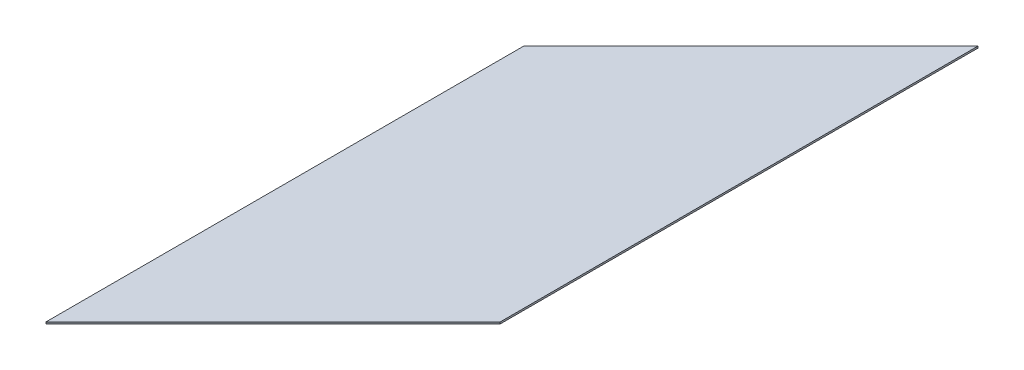
ISO-10303-21;
HEADER;
FILE_DESCRIPTION(('STEP AP214'),'2;1');
FILE_NAME('part.step','',(''),(''),'','','');
FILE_SCHEMA(('AUTOMOTIVE_DESIGN { 1 0 10303 214 1 1 1 1 }'));
ENDSEC;
DATA;
#1=APPLICATION_CONTEXT('core data for automotive mechanical design processes');
#2=APPLICATION_PROTOCOL_DEFINITION('international standard','automotive_design',2000,#1);
#3=PRODUCT_CONTEXT('',#1,'mechanical');
#4=PRODUCT('Part','Part','',(#3));
#5=PRODUCT_RELATED_PRODUCT_CATEGORY('part','',(#4));
#6=PRODUCT_DEFINITION_FORMATION('','',#4);
#7=PRODUCT_DEFINITION_CONTEXT('part definition',#1,'design');
#8=PRODUCT_DEFINITION('design','',#6,#7);
#9=PRODUCT_DEFINITION_SHAPE('','',#8);
#10=(LENGTH_UNIT() NAMED_UNIT(*) SI_UNIT(.MILLI.,.METRE.));
#11=(NAMED_UNIT(*) PLANE_ANGLE_UNIT() SI_UNIT($,.RADIAN.));
#12=(NAMED_UNIT(*) SI_UNIT($,.STERADIAN.) SOLID_ANGLE_UNIT());
#13=UNCERTAINTY_MEASURE_WITH_UNIT(LENGTH_MEASURE(1.E-05),#10,'distance_accuracy_value','');
#14=(GEOMETRIC_REPRESENTATION_CONTEXT(3) GLOBAL_UNCERTAINTY_ASSIGNED_CONTEXT((#13)) GLOBAL_UNIT_ASSIGNED_CONTEXT((#10,
#11,#12)) REPRESENTATION_CONTEXT('',''));
#15=CARTESIAN_POINT('',(0.,0.,0.));
#16=DIRECTION('',(0.,0.,1.));
#17=DIRECTION('',(1.,0.,0.));
#18=AXIS2_PLACEMENT_3D('',#15,#16,#17);
#19=CARTESIAN_POINT('',(322.196671476108,2.54,0.0022903044861313));
#20=DIRECTION('',(0.999999999974735,0.,7.10840517247014E-06));
#21=DIRECTION('',(7.10840517247014E-06,0.,-0.999999999974735));
#22=AXIS2_PLACEMENT_3D('',#19,#20,#21);
#23=PLANE('',#22);
#24=DIRECTION('',(-7.10840517247014E-06,0.,0.999999999974735));
#25=VECTOR('',#24,1.);
#26=CARTESIAN_POINT('',(322.196671476108,0.,0.0022903044861313));
#27=LINE('',#26,#25);
#28=CARTESIAN_POINT('',(322.20049622294,0.,-538.057476738062));
#29=VERTEX_POINT('',#28);
#30=CARTESIAN_POINT('',(322.2,0.,-468.249562379727));
#31=VERTEX_POINT('',#30);
#32=EDGE_CURVE('E116',#29,#31,#27,.T.);
#33=ORIENTED_EDGE('',*,*,#32,.F.);
#34=DIRECTION('',(0.,-1.,0.));
#35=VECTOR('',#34,1.);
#36=CARTESIAN_POINT('',(322.20049622294,2.54,-538.057476738062));
#37=LINE('',#36,#35);
#38=CARTESIAN_POINT('',(322.20049622294,2.54,-538.057476738062));
#39=VERTEX_POINT('',#38);
#40=EDGE_CURVE('E11',#39,#29,#37,.T.);
#41=ORIENTED_EDGE('',*,*,#40,.F.);
#42=DIRECTION('',(-7.10840517247014E-06,0.,0.999999999974735));
#43=VECTOR('',#42,1.);
#44=CARTESIAN_POINT('',(322.196671476108,2.54,0.0022903044861313));
#45=LINE('',#44,#43);
#46=CARTESIAN_POINT('',(322.2,2.54,-468.249562379727));
#47=VERTEX_POINT('',#46);
#48=EDGE_CURVE('E127',#39,#47,#45,.T.);
#49=ORIENTED_EDGE('',*,*,#48,.T.);
#50=DIRECTION('',(0.,-1.,0.));
#51=VECTOR('',#50,1.);
#52=CARTESIAN_POINT('',(322.2,2.54,-468.249562379727));
#53=LINE('',#52,#51);
#54=EDGE_CURVE('E80',#47,#31,#53,.T.);
#55=ORIENTED_EDGE('',*,*,#54,.T.);
#56=EDGE_LOOP('',(#33,#41,#49,#55));
#57=FACE_BOUND('',#56,.T.);
#58=ADVANCED_FACE('F35',(#57),#23,.T.);
#59=CARTESIAN_POINT('',(322.20049622294,2.54,0.));
#60=DIRECTION('',(-1.,0.,0.));
#61=DIRECTION('',(0.,0.,1.));
#62=AXIS2_PLACEMENT_3D('',#59,#60,#61);
#63=PLANE('',#62);
#64=DIRECTION('',(0.,0.,-1.));
#65=VECTOR('',#64,1.);
#66=CARTESIAN_POINT('',(322.20049622294,0.,0.));
#67=LINE('',#66,#65);
#68=CARTESIAN_POINT('',(322.20049622294,0.,-1000.));
#69=VERTEX_POINT('',#68);
#70=EDGE_CURVE('E119',#29,#69,#67,.T.);
#71=ORIENTED_EDGE('',*,*,#70,.T.);
#72=DIRECTION('',(0.,-1.,0.));
#73=VECTOR('',#72,1.);
#74=CARTESIAN_POINT('',(322.20049622294,2.54,-1000.));
#75=LINE('',#74,#73);
#76=CARTESIAN_POINT('',(322.20049622294,2.54,-1000.));
#77=VERTEX_POINT('',#76);
#78=EDGE_CURVE('E43',#77,#69,#75,.T.);
#79=ORIENTED_EDGE('',*,*,#78,.F.);
#80=DIRECTION('',(0.,0.,-1.));
#81=VECTOR('',#80,1.);
#82=CARTESIAN_POINT('',(322.20049622294,2.54,0.));
#83=LINE('',#82,#81);
#84=EDGE_CURVE('E142',#39,#77,#83,.T.);
#85=ORIENTED_EDGE('',*,*,#84,.F.);
#86=ORIENTED_EDGE('',*,*,#40,.T.);
#87=EDGE_LOOP('',(#71,#79,#85,#86));
#88=FACE_BOUND('',#87,.T.);
#89=ADVANCED_FACE('F145',(#88),#63,.F.);
#90=CARTESIAN_POINT('',(-338.899751888529,2.54,-338.899751888525));
#91=DIRECTION('',(0.707106781186551,0.,0.707106781186544));
#92=DIRECTION('',(0.707106781186544,0.,-0.707106781186551));
#93=AXIS2_PLACEMENT_3D('',#90,#91,#92);
#94=PLANE('',#93);
#95=DIRECTION('',(-0.707106781186544,0.,0.707106781186551));
#96=VECTOR('',#95,1.);
#97=CARTESIAN_POINT('',(-338.899751888529,0.,-338.899751888525));
#98=LINE('',#97,#96);
#99=CARTESIAN_POINT('',(0.,0.,-677.799503777057));
#100=VERTEX_POINT('',#99);
#101=EDGE_CURVE('E121',#69,#100,#98,.T.);
#102=ORIENTED_EDGE('',*,*,#101,.T.);
#103=DIRECTION('',(0.,-1.,0.));
#104=VECTOR('',#103,1.);
#105=CARTESIAN_POINT('',(0.,2.54,-677.799503777057));
#106=LINE('',#105,#104);
#107=CARTESIAN_POINT('',(0.,2.54,-677.799503777057));
#108=VERTEX_POINT('',#107);
#109=EDGE_CURVE('E108',#108,#100,#106,.T.);
#110=ORIENTED_EDGE('',*,*,#109,.F.);
#111=DIRECTION('',(-0.707106781186544,0.,0.707106781186551));
#112=VECTOR('',#111,1.);
#113=CARTESIAN_POINT('',(-338.899751888529,2.54,-338.899751888525));
#114=LINE('',#113,#112);
#115=EDGE_CURVE('E99',#77,#108,#114,.T.);
#116=ORIENTED_EDGE('',*,*,#115,.F.);
#117=ORIENTED_EDGE('',*,*,#78,.T.);
#118=EDGE_LOOP('',(#102,#110,#116,#117));
#119=FACE_BOUND('',#118,.T.);
#120=ADVANCED_FACE('F134',(#119),#94,.F.);
#121=CARTESIAN_POINT('',(0.,2.54,0.));
#122=DIRECTION('',(1.,0.,0.));
#123=DIRECTION('',(0.,0.,-1.));
#124=AXIS2_PLACEMENT_3D('',#121,#122,#123);
#125=PLANE('',#124);
#126=DIRECTION('',(0.,0.,1.));
#127=VECTOR('',#126,1.);
#128=CARTESIAN_POINT('',(0.,0.,0.));
#129=LINE('',#128,#127);
#130=CARTESIAN_POINT('',(0.,0.,0.));
#131=VERTEX_POINT('',#130);
#132=EDGE_CURVE('E107',#100,#131,#129,.T.);
#133=ORIENTED_EDGE('',*,*,#132,.T.);
#134=DIRECTION('',(0.,-1.,0.));
#135=VECTOR('',#134,1.);
#136=CARTESIAN_POINT('',(0.,2.54,0.));
#137=LINE('',#136,#135);
#138=CARTESIAN_POINT('',(0.,2.54,0.));
#139=VERTEX_POINT('',#138);
#140=EDGE_CURVE('E104',#139,#131,#137,.T.);
#141=ORIENTED_EDGE('',*,*,#140,.F.);
#142=DIRECTION('',(0.,0.,1.));
#143=VECTOR('',#142,1.);
#144=CARTESIAN_POINT('',(0.,2.54,0.));
#145=LINE('',#144,#143);
#146=EDGE_CURVE('E93',#108,#139,#145,.T.);
#147=ORIENTED_EDGE('',*,*,#146,.F.);
#148=ORIENTED_EDGE('',*,*,#109,.T.);
#149=EDGE_LOOP('',(#133,#141,#147,#148));
#150=FACE_BOUND('',#149,.T.);
#151=ADVANCED_FACE('F105',(#150),#125,.F.);
#152=CARTESIAN_POINT('',(0.,2.54,0.));
#153=DIRECTION('',(-0.707106781186551,0.,-0.707106781186544));
#154=DIRECTION('',(-0.707106781186544,0.,0.707106781186551));
#155=AXIS2_PLACEMENT_3D('',#152,#153,#154);
#156=PLANE('',#155);
#157=DIRECTION('',(0.707106781186544,0.,-0.707106781186551));
#158=VECTOR('',#157,1.);
#159=CARTESIAN_POINT('',(0.,0.,0.));
#160=LINE('',#159,#158);
#161=CARTESIAN_POINT('',(322.2,0.,-322.200000000003));
#162=VERTEX_POINT('',#161);
#163=EDGE_CURVE('E73',#131,#162,#160,.T.);
#164=ORIENTED_EDGE('',*,*,#163,.T.);
#165=DIRECTION('',(0.,-1.,0.));
#166=VECTOR('',#165,1.);
#167=CARTESIAN_POINT('',(322.2,2.54,-322.200000000003));
#168=LINE('',#167,#166);
#169=CARTESIAN_POINT('',(322.2,2.54,-322.200000000003));
#170=VERTEX_POINT('',#169);
#171=EDGE_CURVE('E109',#170,#162,#168,.T.);
#172=ORIENTED_EDGE('',*,*,#171,.F.);
#173=DIRECTION('',(0.707106781186544,0.,-0.707106781186551));
#174=VECTOR('',#173,1.);
#175=CARTESIAN_POINT('',(0.,2.54,0.));
#176=LINE('',#175,#174);
#177=EDGE_CURVE('E97',#139,#170,#176,.T.);
#178=ORIENTED_EDGE('',*,*,#177,.F.);
#179=ORIENTED_EDGE('',*,*,#140,.T.);
#180=EDGE_LOOP('',(#164,#172,#178,#179));
#181=FACE_BOUND('',#180,.T.);
#182=ADVANCED_FACE('F111',(#181),#156,.F.);
#183=CARTESIAN_POINT('',(322.2,2.54,0.));
#184=DIRECTION('',(-1.,0.,0.));
#185=DIRECTION('',(0.,0.,1.));
#186=AXIS2_PLACEMENT_3D('',#183,#184,#185);
#187=PLANE('',#186);
#188=DIRECTION('',(0.,0.,-1.));
#189=VECTOR('',#188,1.);
#190=CARTESIAN_POINT('',(322.2,0.,0.));
#191=LINE('',#190,#189);
#192=EDGE_CURVE('E125',#162,#31,#191,.T.);
#193=ORIENTED_EDGE('',*,*,#192,.T.);
#194=ORIENTED_EDGE('',*,*,#54,.F.);
#195=DIRECTION('',(0.,0.,-1.));
#196=VECTOR('',#195,1.);
#197=CARTESIAN_POINT('',(322.2,2.54,0.));
#198=LINE('',#197,#196);
#199=EDGE_CURVE('E51',#170,#47,#198,.T.);
#200=ORIENTED_EDGE('',*,*,#199,.F.);
#201=ORIENTED_EDGE('',*,*,#171,.T.);
#202=EDGE_LOOP('',(#193,#194,#200,#201));
#203=FACE_BOUND('',#202,.T.);
#204=ADVANCED_FACE('F141',(#203),#187,.F.);
#205=CARTESIAN_POINT('',(0.,2.54,0.));
#206=DIRECTION('',(0.,1.,0.));
#207=DIRECTION('',(0.,0.,1.));
#208=AXIS2_PLACEMENT_3D('',#205,#206,#207);
#209=PLANE('',#208);
#210=ORIENTED_EDGE('',*,*,#48,.F.);
#211=ORIENTED_EDGE('',*,*,#84,.T.);
#212=ORIENTED_EDGE('',*,*,#115,.T.);
#213=ORIENTED_EDGE('',*,*,#146,.T.);
#214=ORIENTED_EDGE('',*,*,#177,.T.);
#215=ORIENTED_EDGE('',*,*,#199,.T.);
#216=EDGE_LOOP('',(#210,#211,#212,#213,#214,#215));
#217=FACE_BOUND('',#216,.T.);
#218=ADVANCED_FACE('F95',(#217),#209,.T.);
#219=CARTESIAN_POINT('',(0.,0.,0.));
#220=DIRECTION('',(0.,1.,0.));
#221=DIRECTION('',(0.,0.,1.));
#222=AXIS2_PLACEMENT_3D('',#219,#220,#221);
#223=PLANE('',#222);
#224=ORIENTED_EDGE('',*,*,#32,.T.);
#225=ORIENTED_EDGE('',*,*,#192,.F.);
#226=ORIENTED_EDGE('',*,*,#163,.F.);
#227=ORIENTED_EDGE('',*,*,#132,.F.);
#228=ORIENTED_EDGE('',*,*,#101,.F.);
#229=ORIENTED_EDGE('',*,*,#70,.F.);
#230=EDGE_LOOP('',(#224,#225,#226,#227,#228,#229));
#231=FACE_BOUND('',#230,.T.);
#232=ADVANCED_FACE('F138',(#231),#223,.F.);
#233=CLOSED_SHELL('',(#58,#89,#120,#151,#182,#204,#218,#232));
#234=MANIFOLD_SOLID_BREP('B2',#233);
#235=ADVANCED_BREP_SHAPE_REPRESENTATION('',(#18,#234),#14);
#236=SHAPE_DEFINITION_REPRESENTATION(#9,#235);
ENDSEC;
END-ISO-10303-21;
